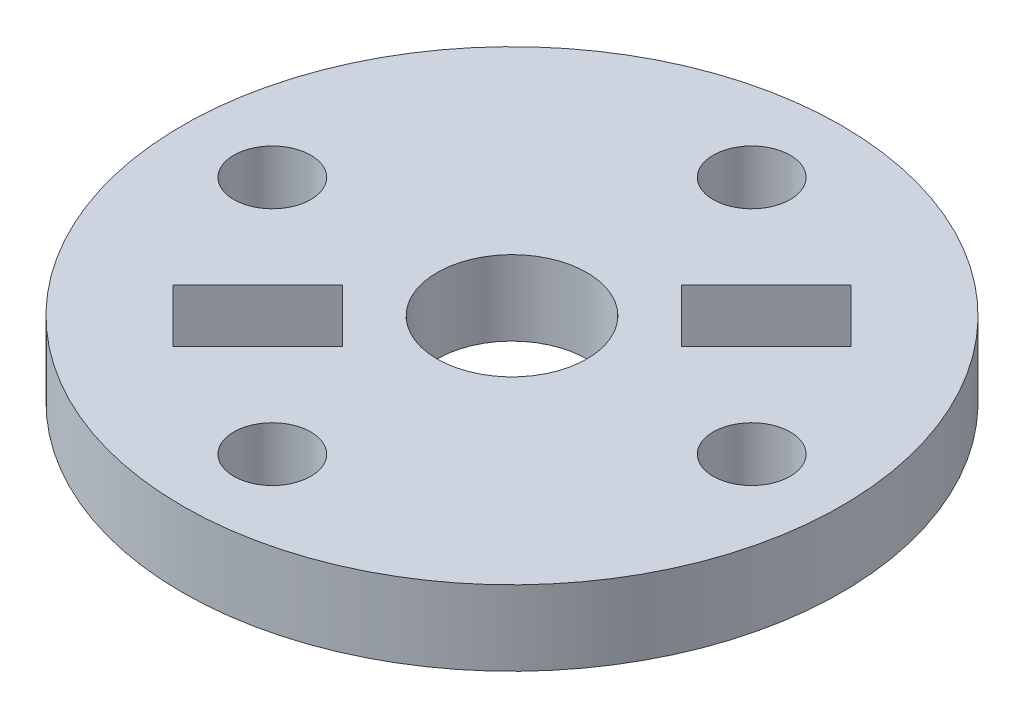
ISO-10303-21;
HEADER;
FILE_DESCRIPTION(('STEP AP214'),'2;1');
FILE_NAME('part.step','',(''),(''),'','','');
FILE_SCHEMA(('AUTOMOTIVE_DESIGN { 1 0 10303 214 1 1 1 1 }'));
ENDSEC;
DATA;
#1=APPLICATION_CONTEXT('core data for automotive mechanical design processes');
#2=APPLICATION_PROTOCOL_DEFINITION('international standard','automotive_design',2000,#1);
#3=PRODUCT_CONTEXT('',#1,'mechanical');
#4=PRODUCT('Part','Part','',(#3));
#5=PRODUCT_RELATED_PRODUCT_CATEGORY('part','',(#4));
#6=PRODUCT_DEFINITION_FORMATION('','',#4);
#7=PRODUCT_DEFINITION_CONTEXT('part definition',#1,'design');
#8=PRODUCT_DEFINITION('design','',#6,#7);
#9=PRODUCT_DEFINITION_SHAPE('','',#8);
#10=(LENGTH_UNIT() NAMED_UNIT(*) SI_UNIT(.MILLI.,.METRE.));
#11=(NAMED_UNIT(*) PLANE_ANGLE_UNIT() SI_UNIT($,.RADIAN.));
#12=(NAMED_UNIT(*) SI_UNIT($,.STERADIAN.) SOLID_ANGLE_UNIT());
#13=UNCERTAINTY_MEASURE_WITH_UNIT(LENGTH_MEASURE(1.E-05),#10,'distance_accuracy_value','');
#14=(GEOMETRIC_REPRESENTATION_CONTEXT(3) GLOBAL_UNCERTAINTY_ASSIGNED_CONTEXT((#13)) GLOBAL_UNIT_ASSIGNED_CONTEXT((#10,
#11,#12)) REPRESENTATION_CONTEXT('',''));
#15=CARTESIAN_POINT('',(0.,0.,0.));
#16=DIRECTION('',(0.,0.,1.));
#17=DIRECTION('',(1.,0.,0.));
#18=AXIS2_PLACEMENT_3D('',#15,#16,#17);
#19=CARTESIAN_POINT('',(0.,3.175,0.));
#20=DIRECTION('',(0.,-1.,0.));
#21=DIRECTION('',(0.,0.,-1.));
#22=AXIS2_PLACEMENT_3D('',#19,#20,#21);
#23=CYLINDRICAL_SURFACE('',#22,13.97);
#24=CARTESIAN_POINT('',(0.,3.175,0.));
#25=DIRECTION('',(0.,1.,0.));
#26=DIRECTION('',(0.,0.,1.));
#27=AXIS2_PLACEMENT_3D('',#24,#25,#26);
#28=CIRCLE('',#27,13.97);
#29=CARTESIAN_POINT('',(0.,3.175,13.97));
#30=VERTEX_POINT('',#29);
#31=EDGE_CURVE('E172',#30,#30,#28,.T.);
#32=ORIENTED_EDGE('',*,*,#31,.F.);
#33=EDGE_LOOP('',(#32));
#34=FACE_BOUND('',#33,.T.);
#35=CARTESIAN_POINT('',(0.,0.,0.));
#36=DIRECTION('',(0.,1.,0.));
#37=DIRECTION('',(0.,0.,1.));
#38=AXIS2_PLACEMENT_3D('',#35,#36,#37);
#39=CIRCLE('',#38,13.97);
#40=CARTESIAN_POINT('',(0.,0.,13.97));
#41=VERTEX_POINT('',#40);
#42=EDGE_CURVE('E169',#41,#41,#39,.T.);
#43=ORIENTED_EDGE('',*,*,#42,.T.);
#44=EDGE_LOOP('',(#43));
#45=FACE_BOUND('',#44,.T.);
#46=ADVANCED_FACE('F35',(#34,#45),#23,.T.);
#47=CARTESIAN_POINT('',(0.,3.175,0.));
#48=DIRECTION('',(0.,1.,0.));
#49=DIRECTION('',(0.,0.,1.));
#50=AXIS2_PLACEMENT_3D('',#47,#48,#49);
#51=PLANE('',#50);
#52=DIRECTION('',(-0.707106781186548,0.,-0.707106781186547));
#53=VECTOR('',#52,1.);
#54=CARTESIAN_POINT('',(-4.71463446356131,3.175,2.46957043329401));
#55=LINE('',#54,#53);
#56=CARTESIAN_POINT('',(-2.46957043329403,3.175,4.71463446356129));
#57=VERTEX_POINT('',#56);
#58=CARTESIAN_POINT('',(-4.71463446356131,3.175,2.46957043329401));
#59=VERTEX_POINT('',#58);
#60=EDGE_CURVE('E49',#57,#59,#55,.T.);
#61=ORIENTED_EDGE('',*,*,#60,.F.);
#62=DIRECTION('',(0.707106781186548,0.,-0.707106781186548));
#63=VECTOR('',#62,1.);
#64=CARTESIAN_POINT('',(-2.46957043329403,3.175,4.71463446356129));
#65=LINE('',#64,#63);
#66=CARTESIAN_POINT('',(-6.06167288172169,3.175,8.30673691198895));
#67=VERTEX_POINT('',#66);
#68=EDGE_CURVE('E118',#67,#57,#65,.T.);
#69=ORIENTED_EDGE('',*,*,#68,.F.);
#70=DIRECTION('',(0.707106781186548,0.,0.707106781186547));
#71=VECTOR('',#70,1.);
#72=CARTESIAN_POINT('',(-8.30673691198898,3.175,6.06167288172167));
#73=LINE('',#72,#71);
#74=CARTESIAN_POINT('',(-8.30673691198898,3.175,6.06167288172167));
#75=VERTEX_POINT('',#74);
#76=EDGE_CURVE('E102',#75,#67,#73,.T.);
#77=ORIENTED_EDGE('',*,*,#76,.F.);
#78=DIRECTION('',(-0.707106781186548,0.,0.707106781186548));
#79=VECTOR('',#78,1.);
#80=CARTESIAN_POINT('',(-4.71463446356131,3.175,2.46957043329401));
#81=LINE('',#80,#79);
#82=EDGE_CURVE('E111',#59,#75,#81,.T.);
#83=ORIENTED_EDGE('',*,*,#82,.F.);
#84=EDGE_LOOP('',(#61,#69,#77,#83));
#85=FACE_BOUND('',#84,.T.);
#86=DIRECTION('',(0.707106781186548,0.,0.707106781186547));
#87=VECTOR('',#86,1.);
#88=CARTESIAN_POINT('',(4.71463446356131,3.175,-2.46957043329401));
#89=LINE('',#88,#87);
#90=CARTESIAN_POINT('',(2.46957043329403,3.175,-4.71463446356129));
#91=VERTEX_POINT('',#90);
#92=CARTESIAN_POINT('',(4.71463446356131,3.175,-2.46957043329401));
#93=VERTEX_POINT('',#92);
#94=EDGE_CURVE('E125',#91,#93,#89,.T.);
#95=ORIENTED_EDGE('',*,*,#94,.F.);
#96=DIRECTION('',(-0.707106781186548,0.,0.707106781186548));
#97=VECTOR('',#96,1.);
#98=CARTESIAN_POINT('',(2.46957043329403,3.175,-4.71463446356129));
#99=LINE('',#98,#97);
#100=CARTESIAN_POINT('',(6.06167288172169,3.175,-8.30673691198895));
#101=VERTEX_POINT('',#100);
#102=EDGE_CURVE('E135',#101,#91,#99,.T.);
#103=ORIENTED_EDGE('',*,*,#102,.F.);
#104=DIRECTION('',(-0.707106781186548,0.,-0.707106781186547));
#105=VECTOR('',#104,1.);
#106=CARTESIAN_POINT('',(8.30673691198898,3.175,-6.06167288172167));
#107=LINE('',#106,#105);
#108=CARTESIAN_POINT('',(8.30673691198898,3.175,-6.06167288172167));
#109=VERTEX_POINT('',#108);
#110=EDGE_CURVE('E132',#109,#101,#107,.T.);
#111=ORIENTED_EDGE('',*,*,#110,.F.);
#112=DIRECTION('',(0.707106781186548,0.,-0.707106781186548));
#113=VECTOR('',#112,1.);
#114=CARTESIAN_POINT('',(4.71463446356131,3.175,-2.46957043329401));
#115=LINE('',#114,#113);
#116=EDGE_CURVE('E129',#93,#109,#115,.T.);
#117=ORIENTED_EDGE('',*,*,#116,.F.);
#118=EDGE_LOOP('',(#95,#103,#111,#117));
#119=FACE_BOUND('',#118,.T.);
#120=CARTESIAN_POINT('',(10.16,3.175,-1.06420351207939E-13));
#121=DIRECTION('',(0.,1.,0.));
#122=DIRECTION('',(0.,0.,1.));
#123=AXIS2_PLACEMENT_3D('',#120,#121,#122);
#124=CIRCLE('',#123,1.63195);
#125=CARTESIAN_POINT('',(10.16,3.175,1.63194999999989));
#126=VERTEX_POINT('',#125);
#127=EDGE_CURVE('E141',#126,#126,#124,.T.);
#128=ORIENTED_EDGE('',*,*,#127,.F.);
#129=EDGE_LOOP('',(#128));
#130=FACE_BOUND('',#129,.T.);
#131=CARTESIAN_POINT('',(0.,3.175,10.16));
#132=DIRECTION('',(0.,1.,0.));
#133=DIRECTION('',(0.,0.,1.));
#134=AXIS2_PLACEMENT_3D('',#131,#132,#133);
#135=CIRCLE('',#134,1.63195);
#136=CARTESIAN_POINT('',(0.,3.175,11.79195));
#137=VERTEX_POINT('',#136);
#138=EDGE_CURVE('E151',#137,#137,#135,.T.);
#139=ORIENTED_EDGE('',*,*,#138,.F.);
#140=EDGE_LOOP('',(#139));
#141=FACE_BOUND('',#140,.T.);
#142=CARTESIAN_POINT('',(-10.16,3.175,0.));
#143=DIRECTION('',(0.,1.,0.));
#144=DIRECTION('',(0.,0.,1.));
#145=AXIS2_PLACEMENT_3D('',#142,#143,#144);
#146=CIRCLE('',#145,1.63195);
#147=CARTESIAN_POINT('',(-10.16,3.175,1.63195000000003));
#148=VERTEX_POINT('',#147);
#149=EDGE_CURVE('E155',#148,#148,#146,.T.);
#150=ORIENTED_EDGE('',*,*,#149,.F.);
#151=EDGE_LOOP('',(#150));
#152=FACE_BOUND('',#151,.T.);
#153=CARTESIAN_POINT('',(0.,3.175,-10.16));
#154=DIRECTION('',(0.,1.,0.));
#155=DIRECTION('',(0.,0.,1.));
#156=AXIS2_PLACEMENT_3D('',#153,#154,#155);
#157=CIRCLE('',#156,1.63195);
#158=CARTESIAN_POINT('',(0.,3.175,-8.52805));
#159=VERTEX_POINT('',#158);
#160=EDGE_CURVE('E159',#159,#159,#157,.T.);
#161=ORIENTED_EDGE('',*,*,#160,.F.);
#162=EDGE_LOOP('',(#161));
#163=FACE_BOUND('',#162,.T.);
#164=CARTESIAN_POINT('',(0.,3.175,0.));
#165=DIRECTION('',(0.,1.,0.));
#166=DIRECTION('',(0.,0.,1.));
#167=AXIS2_PLACEMENT_3D('',#164,#165,#166);
#168=CIRCLE('',#167,3.175);
#169=CARTESIAN_POINT('',(0.,3.175,3.175));
#170=VERTEX_POINT('',#169);
#171=EDGE_CURVE('E165',#170,#170,#168,.T.);
#172=ORIENTED_EDGE('',*,*,#171,.F.);
#173=EDGE_LOOP('',(#172));
#174=FACE_BOUND('',#173,.T.);
#175=ORIENTED_EDGE('',*,*,#31,.T.);
#176=EDGE_LOOP('',(#175));
#177=FACE_BOUND('',#176,.T.);
#178=ADVANCED_FACE('F115',(#85,#119,#130,#141,#152,#163,#174,#177),#51,.T.);
#179=CARTESIAN_POINT('',(0.,0.,0.));
#180=DIRECTION('',(0.,1.,0.));
#181=DIRECTION('',(0.,0.,1.));
#182=AXIS2_PLACEMENT_3D('',#179,#180,#181);
#183=PLANE('',#182);
#184=DIRECTION('',(0.707106781186548,0.,-0.707106781186548));
#185=VECTOR('',#184,1.);
#186=CARTESIAN_POINT('',(1.12253201513363,0.,1.12253201513363));
#187=LINE('',#186,#185);
#188=CARTESIAN_POINT('',(-6.06167288172169,0.,8.30673691198895));
#189=VERTEX_POINT('',#188);
#190=CARTESIAN_POINT('',(-2.46957043329403,0.,4.71463446356129));
#191=VERTEX_POINT('',#190);
#192=EDGE_CURVE('E42',#189,#191,#187,.T.);
#193=ORIENTED_EDGE('',*,*,#192,.T.);
#194=DIRECTION('',(-0.707106781186548,0.,-0.707106781186547));
#195=VECTOR('',#194,1.);
#196=CARTESIAN_POINT('',(-3.59210244842766,0.,3.59210244842766));
#197=LINE('',#196,#195);
#198=CARTESIAN_POINT('',(-4.71463446356131,0.,2.46957043329401));
#199=VERTEX_POINT('',#198);
#200=EDGE_CURVE('E11',#191,#199,#197,.T.);
#201=ORIENTED_EDGE('',*,*,#200,.T.);
#202=DIRECTION('',(-0.707106781186548,0.,0.707106781186548));
#203=VECTOR('',#202,1.);
#204=CARTESIAN_POINT('',(-1.12253201513365,0.,-1.12253201513365));
#205=LINE('',#204,#203);
#206=CARTESIAN_POINT('',(-8.30673691198898,0.,6.06167288172167));
#207=VERTEX_POINT('',#206);
#208=EDGE_CURVE('E195',#199,#207,#205,.T.);
#209=ORIENTED_EDGE('',*,*,#208,.T.);
#210=DIRECTION('',(0.707106781186548,0.,0.707106781186547));
#211=VECTOR('',#210,1.);
#212=CARTESIAN_POINT('',(-7.18420489685532,0.,7.18420489685533));
#213=LINE('',#212,#211);
#214=EDGE_CURVE('E105',#207,#189,#213,.T.);
#215=ORIENTED_EDGE('',*,*,#214,.T.);
#216=EDGE_LOOP('',(#193,#201,#209,#215));
#217=FACE_BOUND('',#216,.T.);
#218=DIRECTION('',(-0.707106781186548,0.,0.707106781186548));
#219=VECTOR('',#218,1.);
#220=CARTESIAN_POINT('',(-1.12253201513363,0.,-1.12253201513363));
#221=LINE('',#220,#219);
#222=CARTESIAN_POINT('',(6.06167288172169,0.,-8.30673691198895));
#223=VERTEX_POINT('',#222);
#224=CARTESIAN_POINT('',(2.46957043329403,0.,-4.71463446356129));
#225=VERTEX_POINT('',#224);
#226=EDGE_CURVE('E189',#223,#225,#221,.T.);
#227=ORIENTED_EDGE('',*,*,#226,.T.);
#228=DIRECTION('',(0.707106781186548,0.,0.707106781186547));
#229=VECTOR('',#228,1.);
#230=CARTESIAN_POINT('',(3.59210244842766,0.,-3.59210244842766));
#231=LINE('',#230,#229);
#232=CARTESIAN_POINT('',(4.71463446356131,0.,-2.46957043329401));
#233=VERTEX_POINT('',#232);
#234=EDGE_CURVE('E192',#225,#233,#231,.T.);
#235=ORIENTED_EDGE('',*,*,#234,.T.);
#236=DIRECTION('',(0.707106781186548,0.,-0.707106781186548));
#237=VECTOR('',#236,1.);
#238=CARTESIAN_POINT('',(1.12253201513365,0.,1.12253201513365));
#239=LINE('',#238,#237);
#240=CARTESIAN_POINT('',(8.30673691198898,0.,-6.06167288172167));
#241=VERTEX_POINT('',#240);
#242=EDGE_CURVE('E175',#233,#241,#239,.T.);
#243=ORIENTED_EDGE('',*,*,#242,.T.);
#244=DIRECTION('',(-0.707106781186548,0.,-0.707106781186547));
#245=VECTOR('',#244,1.);
#246=CARTESIAN_POINT('',(7.18420489685532,0.,-7.18420489685533));
#247=LINE('',#246,#245);
#248=EDGE_CURVE('E186',#241,#223,#247,.T.);
#249=ORIENTED_EDGE('',*,*,#248,.T.);
#250=EDGE_LOOP('',(#227,#235,#243,#249));
#251=FACE_BOUND('',#250,.T.);
#252=CARTESIAN_POINT('',(10.16,0.,-1.06420351207939E-13));
#253=DIRECTION('',(0.,1.,0.));
#254=DIRECTION('',(0.,0.,1.));
#255=AXIS2_PLACEMENT_3D('',#252,#253,#254);
#256=CIRCLE('',#255,1.63195);
#257=CARTESIAN_POINT('',(10.16,0.,1.63194999999989));
#258=VERTEX_POINT('',#257);
#259=EDGE_CURVE('E150',#258,#258,#256,.T.);
#260=ORIENTED_EDGE('',*,*,#259,.T.);
#261=EDGE_LOOP('',(#260));
#262=FACE_BOUND('',#261,.T.);
#263=CARTESIAN_POINT('',(0.,0.,10.16));
#264=DIRECTION('',(0.,1.,0.));
#265=DIRECTION('',(0.,0.,1.));
#266=AXIS2_PLACEMENT_3D('',#263,#264,#265);
#267=CIRCLE('',#266,1.63195);
#268=CARTESIAN_POINT('',(0.,0.,11.79195));
#269=VERTEX_POINT('',#268);
#270=EDGE_CURVE('E154',#269,#269,#267,.T.);
#271=ORIENTED_EDGE('',*,*,#270,.T.);
#272=EDGE_LOOP('',(#271));
#273=FACE_BOUND('',#272,.T.);
#274=CARTESIAN_POINT('',(-10.16,0.,0.));
#275=DIRECTION('',(0.,1.,0.));
#276=DIRECTION('',(0.,0.,1.));
#277=AXIS2_PLACEMENT_3D('',#274,#275,#276);
#278=CIRCLE('',#277,1.63195);
#279=CARTESIAN_POINT('',(-10.16,0.,1.63195000000003));
#280=VERTEX_POINT('',#279);
#281=EDGE_CURVE('E158',#280,#280,#278,.T.);
#282=ORIENTED_EDGE('',*,*,#281,.T.);
#283=EDGE_LOOP('',(#282));
#284=FACE_BOUND('',#283,.T.);
#285=CARTESIAN_POINT('',(0.,0.,-10.16));
#286=DIRECTION('',(0.,1.,0.));
#287=DIRECTION('',(0.,0.,1.));
#288=AXIS2_PLACEMENT_3D('',#285,#286,#287);
#289=CIRCLE('',#288,1.63195);
#290=CARTESIAN_POINT('',(0.,0.,-8.52805));
#291=VERTEX_POINT('',#290);
#292=EDGE_CURVE('E162',#291,#291,#289,.T.);
#293=ORIENTED_EDGE('',*,*,#292,.T.);
#294=EDGE_LOOP('',(#293));
#295=FACE_BOUND('',#294,.T.);
#296=CARTESIAN_POINT('',(0.,0.,0.));
#297=DIRECTION('',(0.,1.,0.));
#298=DIRECTION('',(0.,0.,1.));
#299=AXIS2_PLACEMENT_3D('',#296,#297,#298);
#300=CIRCLE('',#299,3.175);
#301=CARTESIAN_POINT('',(0.,0.,3.175));
#302=VERTEX_POINT('',#301);
#303=EDGE_CURVE('E166',#302,#302,#300,.T.);
#304=ORIENTED_EDGE('',*,*,#303,.T.);
#305=EDGE_LOOP('',(#304));
#306=FACE_BOUND('',#305,.T.);
#307=ORIENTED_EDGE('',*,*,#42,.F.);
#308=EDGE_LOOP('',(#307));
#309=FACE_BOUND('',#308,.T.);
#310=ADVANCED_FACE('F199',(#217,#251,#262,#273,#284,#295,#306,#309),#183,.F.);
#311=CARTESIAN_POINT('',(0.,0.,0.));
#312=DIRECTION('',(0.,1.,0.));
#313=DIRECTION('',(0.,0.,1.));
#314=AXIS2_PLACEMENT_3D('',#311,#312,#313);
#315=CYLINDRICAL_SURFACE('',#314,3.175);
#316=ORIENTED_EDGE('',*,*,#303,.F.);
#317=EDGE_LOOP('',(#316));
#318=FACE_BOUND('',#317,.T.);
#319=ORIENTED_EDGE('',*,*,#171,.T.);
#320=EDGE_LOOP('',(#319));
#321=FACE_BOUND('',#320,.T.);
#322=ADVANCED_FACE('F229',(#318,#321),#315,.F.);
#323=CARTESIAN_POINT('',(0.,3.175,-10.16));
#324=DIRECTION('',(0.,1.,0.));
#325=DIRECTION('',(0.,0.,1.));
#326=AXIS2_PLACEMENT_3D('',#323,#324,#325);
#327=CYLINDRICAL_SURFACE('',#326,1.63195);
#328=ORIENTED_EDGE('',*,*,#160,.T.);
#329=EDGE_LOOP('',(#328));
#330=FACE_BOUND('',#329,.T.);
#331=ORIENTED_EDGE('',*,*,#292,.F.);
#332=EDGE_LOOP('',(#331));
#333=FACE_BOUND('',#332,.T.);
#334=ADVANCED_FACE('F233',(#330,#333),#327,.F.);
#335=CARTESIAN_POINT('',(-10.16,3.175,0.));
#336=DIRECTION('',(0.,1.,0.));
#337=DIRECTION('',(0.,0.,1.));
#338=AXIS2_PLACEMENT_3D('',#335,#336,#337);
#339=CYLINDRICAL_SURFACE('',#338,1.63195);
#340=ORIENTED_EDGE('',*,*,#149,.T.);
#341=EDGE_LOOP('',(#340));
#342=FACE_BOUND('',#341,.T.);
#343=ORIENTED_EDGE('',*,*,#281,.F.);
#344=EDGE_LOOP('',(#343));
#345=FACE_BOUND('',#344,.T.);
#346=ADVANCED_FACE('F239',(#342,#345),#339,.F.);
#347=CARTESIAN_POINT('',(0.,3.175,10.16));
#348=DIRECTION('',(0.,1.,0.));
#349=DIRECTION('',(0.,0.,1.));
#350=AXIS2_PLACEMENT_3D('',#347,#348,#349);
#351=CYLINDRICAL_SURFACE('',#350,1.63195);
#352=ORIENTED_EDGE('',*,*,#138,.T.);
#353=EDGE_LOOP('',(#352));
#354=FACE_BOUND('',#353,.T.);
#355=ORIENTED_EDGE('',*,*,#270,.F.);
#356=EDGE_LOOP('',(#355));
#357=FACE_BOUND('',#356,.T.);
#358=ADVANCED_FACE('F243',(#354,#357),#351,.F.);
#359=CARTESIAN_POINT('',(10.16,3.175,-1.06420351207939E-13));
#360=DIRECTION('',(0.,1.,0.));
#361=DIRECTION('',(0.,0.,1.));
#362=AXIS2_PLACEMENT_3D('',#359,#360,#361);
#363=CYLINDRICAL_SURFACE('',#362,1.63195);
#364=ORIENTED_EDGE('',*,*,#127,.T.);
#365=EDGE_LOOP('',(#364));
#366=FACE_BOUND('',#365,.T.);
#367=ORIENTED_EDGE('',*,*,#259,.F.);
#368=EDGE_LOOP('',(#367));
#369=FACE_BOUND('',#368,.T.);
#370=ADVANCED_FACE('F247',(#366,#369),#363,.F.);
#371=CARTESIAN_POINT('',(4.71463446356131,-1.905,-2.46957043329401));
#372=DIRECTION('',(-0.707106781186547,0.,0.707106781186548));
#373=DIRECTION('',(0.707106781186548,0.,0.707106781186547));
#374=AXIS2_PLACEMENT_3D('',#371,#372,#373);
#375=PLANE('',#374);
#376=DIRECTION('',(0.,1.,0.));
#377=VECTOR('',#376,1.);
#378=CARTESIAN_POINT('',(2.46957043329403,-1.905,-4.71463446356129));
#379=LINE('',#378,#377);
#380=EDGE_CURVE('E139',#225,#91,#379,.T.);
#381=ORIENTED_EDGE('',*,*,#380,.T.);
#382=ORIENTED_EDGE('',*,*,#94,.T.);
#383=DIRECTION('',(0.,1.,0.));
#384=VECTOR('',#383,1.);
#385=CARTESIAN_POINT('',(4.71463446356131,-1.905,-2.46957043329401));
#386=LINE('',#385,#384);
#387=EDGE_CURVE('E138',#233,#93,#386,.T.);
#388=ORIENTED_EDGE('',*,*,#387,.F.);
#389=ORIENTED_EDGE('',*,*,#234,.F.);
#390=EDGE_LOOP('',(#381,#382,#388,#389));
#391=FACE_BOUND('',#390,.T.);
#392=ADVANCED_FACE('F251',(#391),#375,.F.);
#393=CARTESIAN_POINT('',(2.46957043329403,-1.905,-4.71463446356129));
#394=DIRECTION('',(-0.707106781186548,0.,-0.707106781186548));
#395=DIRECTION('',(-0.707106781186548,0.,0.707106781186548));
#396=AXIS2_PLACEMENT_3D('',#393,#394,#395);
#397=PLANE('',#396);
#398=DIRECTION('',(0.,1.,0.));
#399=VECTOR('',#398,1.);
#400=CARTESIAN_POINT('',(6.06167288172169,-1.905,-8.30673691198895));
#401=LINE('',#400,#399);
#402=EDGE_CURVE('E142',#223,#101,#401,.T.);
#403=ORIENTED_EDGE('',*,*,#402,.T.);
#404=ORIENTED_EDGE('',*,*,#102,.T.);
#405=ORIENTED_EDGE('',*,*,#380,.F.);
#406=ORIENTED_EDGE('',*,*,#226,.F.);
#407=EDGE_LOOP('',(#403,#404,#405,#406));
#408=FACE_BOUND('',#407,.T.);
#409=ADVANCED_FACE('F254',(#408),#397,.F.);
#410=CARTESIAN_POINT('',(8.30673691198898,-1.905,-6.06167288172167));
#411=DIRECTION('',(0.707106781186547,0.,-0.707106781186548));
#412=DIRECTION('',(-0.707106781186548,0.,-0.707106781186547));
#413=AXIS2_PLACEMENT_3D('',#410,#411,#412);
#414=PLANE('',#413);
#415=DIRECTION('',(0.,1.,0.));
#416=VECTOR('',#415,1.);
#417=CARTESIAN_POINT('',(8.30673691198898,-1.905,-6.06167288172167));
#418=LINE('',#417,#416);
#419=EDGE_CURVE('E144',#241,#109,#418,.T.);
#420=ORIENTED_EDGE('',*,*,#419,.T.);
#421=ORIENTED_EDGE('',*,*,#110,.T.);
#422=ORIENTED_EDGE('',*,*,#402,.F.);
#423=ORIENTED_EDGE('',*,*,#248,.F.);
#424=EDGE_LOOP('',(#420,#421,#422,#423));
#425=FACE_BOUND('',#424,.T.);
#426=ADVANCED_FACE('F213',(#425),#414,.F.);
#427=CARTESIAN_POINT('',(4.71463446356131,-1.905,-2.46957043329401));
#428=DIRECTION('',(0.707106781186548,0.,0.707106781186548));
#429=DIRECTION('',(0.707106781186548,0.,-0.707106781186548));
#430=AXIS2_PLACEMENT_3D('',#427,#428,#429);
#431=PLANE('',#430);
#432=ORIENTED_EDGE('',*,*,#387,.T.);
#433=ORIENTED_EDGE('',*,*,#116,.T.);
#434=ORIENTED_EDGE('',*,*,#419,.F.);
#435=ORIENTED_EDGE('',*,*,#242,.F.);
#436=EDGE_LOOP('',(#432,#433,#434,#435));
#437=FACE_BOUND('',#436,.T.);
#438=ADVANCED_FACE('F206',(#437),#431,.F.);
#439=CARTESIAN_POINT('',(-4.71463446356131,-1.905,2.46957043329401));
#440=DIRECTION('',(0.707106781186547,0.,-0.707106781186548));
#441=DIRECTION('',(-0.707106781186548,0.,-0.707106781186547));
#442=AXIS2_PLACEMENT_3D('',#439,#440,#441);
#443=PLANE('',#442);
#444=DIRECTION('',(0.,1.,0.));
#445=VECTOR('',#444,1.);
#446=CARTESIAN_POINT('',(-2.46957043329403,-1.905,4.71463446356129));
#447=LINE('',#446,#445);
#448=EDGE_CURVE('E123',#191,#57,#447,.T.);
#449=ORIENTED_EDGE('',*,*,#448,.T.);
#450=ORIENTED_EDGE('',*,*,#60,.T.);
#451=DIRECTION('',(0.,1.,0.));
#452=VECTOR('',#451,1.);
#453=CARTESIAN_POINT('',(-4.71463446356131,-1.905,2.46957043329401));
#454=LINE('',#453,#452);
#455=EDGE_CURVE('E108',#199,#59,#454,.T.);
#456=ORIENTED_EDGE('',*,*,#455,.F.);
#457=ORIENTED_EDGE('',*,*,#200,.F.);
#458=EDGE_LOOP('',(#449,#450,#456,#457));
#459=FACE_BOUND('',#458,.T.);
#460=ADVANCED_FACE('F204',(#459),#443,.F.);
#461=CARTESIAN_POINT('',(-2.46957043329403,-1.905,4.71463446356129));
#462=DIRECTION('',(0.707106781186548,0.,0.707106781186548));
#463=DIRECTION('',(0.707106781186548,0.,-0.707106781186548));
#464=AXIS2_PLACEMENT_3D('',#461,#462,#463);
#465=PLANE('',#464);
#466=DIRECTION('',(0.,1.,0.));
#467=VECTOR('',#466,1.);
#468=CARTESIAN_POINT('',(-6.06167288172169,-1.905,8.30673691198895));
#469=LINE('',#468,#467);
#470=EDGE_CURVE('E107',#189,#67,#469,.T.);
#471=ORIENTED_EDGE('',*,*,#470,.T.);
#472=ORIENTED_EDGE('',*,*,#68,.T.);
#473=ORIENTED_EDGE('',*,*,#448,.F.);
#474=ORIENTED_EDGE('',*,*,#192,.F.);
#475=EDGE_LOOP('',(#471,#472,#473,#474));
#476=FACE_BOUND('',#475,.T.);
#477=ADVANCED_FACE('F203',(#476),#465,.F.);
#478=CARTESIAN_POINT('',(-8.30673691198898,-1.905,6.06167288172167));
#479=DIRECTION('',(-0.707106781186547,0.,0.707106781186548));
#480=DIRECTION('',(0.707106781186548,0.,0.707106781186547));
#481=AXIS2_PLACEMENT_3D('',#478,#479,#480);
#482=PLANE('',#481);
#483=DIRECTION('',(0.,1.,0.));
#484=VECTOR('',#483,1.);
#485=CARTESIAN_POINT('',(-8.30673691198898,-1.905,6.06167288172167));
#486=LINE('',#485,#484);
#487=EDGE_CURVE('E57',#207,#75,#486,.T.);
#488=ORIENTED_EDGE('',*,*,#487,.T.);
#489=ORIENTED_EDGE('',*,*,#76,.T.);
#490=ORIENTED_EDGE('',*,*,#470,.F.);
#491=ORIENTED_EDGE('',*,*,#214,.F.);
#492=EDGE_LOOP('',(#488,#489,#490,#491));
#493=FACE_BOUND('',#492,.T.);
#494=ADVANCED_FACE('F99',(#493),#482,.F.);
#495=CARTESIAN_POINT('',(-4.71463446356131,-1.905,2.46957043329401));
#496=DIRECTION('',(-0.707106781186548,0.,-0.707106781186548));
#497=DIRECTION('',(-0.707106781186548,0.,0.707106781186548));
#498=AXIS2_PLACEMENT_3D('',#495,#496,#497);
#499=PLANE('',#498);
#500=ORIENTED_EDGE('',*,*,#455,.T.);
#501=ORIENTED_EDGE('',*,*,#82,.T.);
#502=ORIENTED_EDGE('',*,*,#487,.F.);
#503=ORIENTED_EDGE('',*,*,#208,.F.);
#504=EDGE_LOOP('',(#500,#501,#502,#503));
#505=FACE_BOUND('',#504,.T.);
#506=ADVANCED_FACE('F112',(#505),#499,.F.);
#507=CLOSED_SHELL('',(#46,#178,#310,#322,#334,#346,#358,#370,#392,#409,#426,#438,#460,#477,#494,#506));
#508=MANIFOLD_SOLID_BREP('B2',#507);
#509=ADVANCED_BREP_SHAPE_REPRESENTATION('',(#18,#508),#14);
#510=SHAPE_DEFINITION_REPRESENTATION(#9,#509);
ENDSEC;
END-ISO-10303-21;
